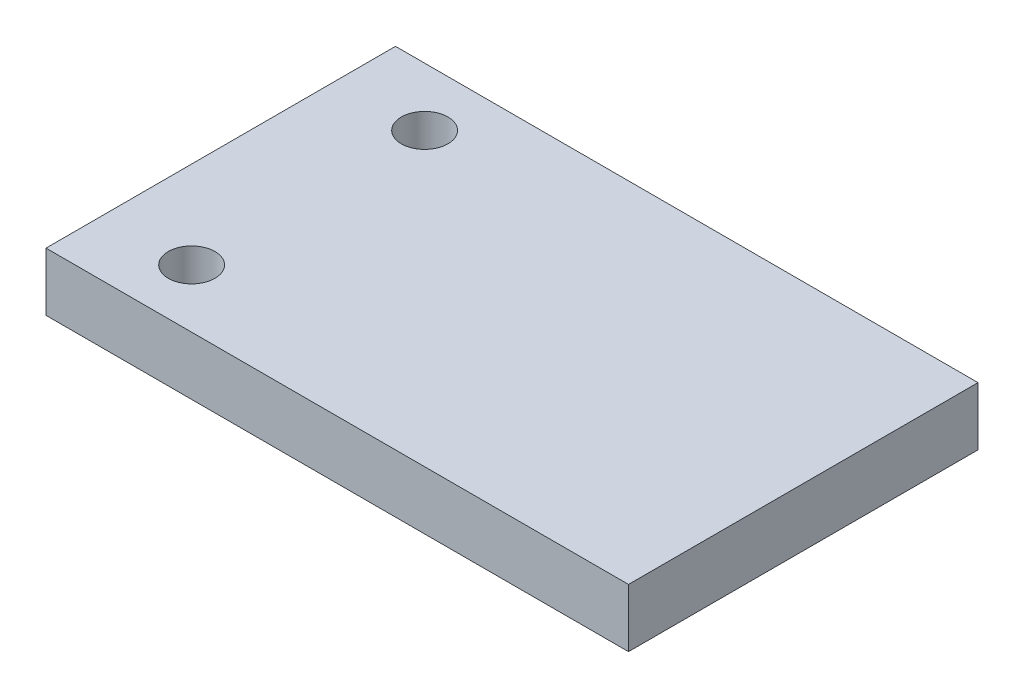
ISO-10303-21;
HEADER;
FILE_DESCRIPTION(('STEP AP214'),'2;1');
FILE_NAME('part.step','',(''),(''),'','','');
FILE_SCHEMA(('AUTOMOTIVE_DESIGN { 1 0 10303 214 1 1 1 1 }'));
ENDSEC;
DATA;
#1=APPLICATION_CONTEXT('core data for automotive mechanical design processes');
#2=APPLICATION_PROTOCOL_DEFINITION('international standard','automotive_design',2000,#1);
#3=PRODUCT_CONTEXT('',#1,'mechanical');
#4=PRODUCT('Part','Part','',(#3));
#5=PRODUCT_RELATED_PRODUCT_CATEGORY('part','',(#4));
#6=PRODUCT_DEFINITION_FORMATION('','',#4);
#7=PRODUCT_DEFINITION_CONTEXT('part definition',#1,'design');
#8=PRODUCT_DEFINITION('design','',#6,#7);
#9=PRODUCT_DEFINITION_SHAPE('','',#8);
#10=(LENGTH_UNIT() NAMED_UNIT(*) SI_UNIT(.MILLI.,.METRE.));
#11=(NAMED_UNIT(*) PLANE_ANGLE_UNIT() SI_UNIT($,.RADIAN.));
#12=(NAMED_UNIT(*) SI_UNIT($,.STERADIAN.) SOLID_ANGLE_UNIT());
#13=UNCERTAINTY_MEASURE_WITH_UNIT(LENGTH_MEASURE(1.E-05),#10,'distance_accuracy_value','');
#14=(GEOMETRIC_REPRESENTATION_CONTEXT(3) GLOBAL_UNCERTAINTY_ASSIGNED_CONTEXT((#13)) GLOBAL_UNIT_ASSIGNED_CONTEXT((#10,
#11,#12)) REPRESENTATION_CONTEXT('',''));
#15=CARTESIAN_POINT('',(0.,0.,0.));
#16=DIRECTION('',(0.,0.,1.));
#17=DIRECTION('',(1.,0.,0.));
#18=AXIS2_PLACEMENT_3D('',#15,#16,#17);
#19=CARTESIAN_POINT('',(-25.,5.,15.));
#20=DIRECTION('',(1.,0.,0.));
#21=DIRECTION('',(0.,0.,-1.));
#22=AXIS2_PLACEMENT_3D('',#19,#20,#21);
#23=PLANE('',#22);
#24=DIRECTION('',(0.,0.,1.));
#25=VECTOR('',#24,1.);
#26=CARTESIAN_POINT('',(-25.,0.,15.));
#27=LINE('',#26,#25);
#28=CARTESIAN_POINT('',(-25.,0.,-15.));
#29=VERTEX_POINT('',#28);
#30=CARTESIAN_POINT('',(-25.,0.,15.));
#31=VERTEX_POINT('',#30);
#32=EDGE_CURVE('E96',#29,#31,#27,.T.);
#33=ORIENTED_EDGE('',*,*,#32,.T.);
#34=DIRECTION('',(0.,-1.,0.));
#35=VECTOR('',#34,1.);
#36=CARTESIAN_POINT('',(-25.,5.,15.));
#37=LINE('',#36,#35);
#38=CARTESIAN_POINT('',(-25.,5.,15.));
#39=VERTEX_POINT('',#38);
#40=EDGE_CURVE('E11',#39,#31,#37,.T.);
#41=ORIENTED_EDGE('',*,*,#40,.F.);
#42=DIRECTION('',(0.,0.,1.));
#43=VECTOR('',#42,1.);
#44=CARTESIAN_POINT('',(-25.,5.,15.));
#45=LINE('',#44,#43);
#46=CARTESIAN_POINT('',(-25.,5.,-15.));
#47=VERTEX_POINT('',#46);
#48=EDGE_CURVE('E84',#47,#39,#45,.T.);
#49=ORIENTED_EDGE('',*,*,#48,.F.);
#50=DIRECTION('',(0.,-1.,0.));
#51=VECTOR('',#50,1.);
#52=CARTESIAN_POINT('',(-25.,5.,-15.));
#53=LINE('',#52,#51);
#54=EDGE_CURVE('E92',#47,#29,#53,.T.);
#55=ORIENTED_EDGE('',*,*,#54,.T.);
#56=EDGE_LOOP('',(#33,#41,#49,#55));
#57=FACE_BOUND('',#56,.T.);
#58=ADVANCED_FACE('F33',(#57),#23,.F.);
#59=CARTESIAN_POINT('',(25.,5.,15.));
#60=DIRECTION('',(0.,0.,-1.));
#61=DIRECTION('',(-1.,0.,0.));
#62=AXIS2_PLACEMENT_3D('',#59,#60,#61);
#63=PLANE('',#62);
#64=DIRECTION('',(1.,0.,0.));
#65=VECTOR('',#64,1.);
#66=CARTESIAN_POINT('',(25.,0.,15.));
#67=LINE('',#66,#65);
#68=CARTESIAN_POINT('',(25.,0.,15.));
#69=VERTEX_POINT('',#68);
#70=EDGE_CURVE('E88',#31,#69,#67,.T.);
#71=ORIENTED_EDGE('',*,*,#70,.T.);
#72=DIRECTION('',(0.,-1.,0.));
#73=VECTOR('',#72,1.);
#74=CARTESIAN_POINT('',(25.,5.,15.));
#75=LINE('',#74,#73);
#76=CARTESIAN_POINT('',(25.,5.,15.));
#77=VERTEX_POINT('',#76);
#78=EDGE_CURVE('E41',#77,#69,#75,.T.);
#79=ORIENTED_EDGE('',*,*,#78,.F.);
#80=DIRECTION('',(1.,0.,0.));
#81=VECTOR('',#80,1.);
#82=CARTESIAN_POINT('',(25.,5.,15.));
#83=LINE('',#82,#81);
#84=EDGE_CURVE('E79',#39,#77,#83,.T.);
#85=ORIENTED_EDGE('',*,*,#84,.F.);
#86=ORIENTED_EDGE('',*,*,#40,.T.);
#87=EDGE_LOOP('',(#71,#79,#85,#86));
#88=FACE_BOUND('',#87,.T.);
#89=ADVANCED_FACE('F87',(#88),#63,.F.);
#90=CARTESIAN_POINT('',(25.,5.,15.));
#91=DIRECTION('',(-1.,0.,0.));
#92=DIRECTION('',(0.,0.,1.));
#93=AXIS2_PLACEMENT_3D('',#90,#91,#92);
#94=PLANE('',#93);
#95=DIRECTION('',(0.,0.,-1.));
#96=VECTOR('',#95,1.);
#97=CARTESIAN_POINT('',(25.,0.,15.));
#98=LINE('',#97,#96);
#99=CARTESIAN_POINT('',(25.,0.,-15.));
#100=VERTEX_POINT('',#99);
#101=EDGE_CURVE('E66',#69,#100,#98,.T.);
#102=ORIENTED_EDGE('',*,*,#101,.T.);
#103=DIRECTION('',(0.,-1.,0.));
#104=VECTOR('',#103,1.);
#105=CARTESIAN_POINT('',(25.,5.,-15.));
#106=LINE('',#105,#104);
#107=CARTESIAN_POINT('',(25.,5.,-15.));
#108=VERTEX_POINT('',#107);
#109=EDGE_CURVE('E89',#108,#100,#106,.T.);
#110=ORIENTED_EDGE('',*,*,#109,.F.);
#111=DIRECTION('',(0.,0.,-1.));
#112=VECTOR('',#111,1.);
#113=CARTESIAN_POINT('',(25.,5.,15.));
#114=LINE('',#113,#112);
#115=EDGE_CURVE('E82',#77,#108,#114,.T.);
#116=ORIENTED_EDGE('',*,*,#115,.F.);
#117=ORIENTED_EDGE('',*,*,#78,.T.);
#118=EDGE_LOOP('',(#102,#110,#116,#117));
#119=FACE_BOUND('',#118,.T.);
#120=ADVANCED_FACE('F90',(#119),#94,.F.);
#121=CARTESIAN_POINT('',(25.,5.,-15.));
#122=DIRECTION('',(0.,0.,1.));
#123=DIRECTION('',(1.,0.,0.));
#124=AXIS2_PLACEMENT_3D('',#121,#122,#123);
#125=PLANE('',#124);
#126=DIRECTION('',(-1.,0.,0.));
#127=VECTOR('',#126,1.);
#128=CARTESIAN_POINT('',(25.,0.,-15.));
#129=LINE('',#128,#127);
#130=EDGE_CURVE('E72',#100,#29,#129,.T.);
#131=ORIENTED_EDGE('',*,*,#130,.T.);
#132=ORIENTED_EDGE('',*,*,#54,.F.);
#133=DIRECTION('',(-1.,0.,0.));
#134=VECTOR('',#133,1.);
#135=CARTESIAN_POINT('',(25.,5.,-15.));
#136=LINE('',#135,#134);
#137=EDGE_CURVE('E49',#108,#47,#136,.T.);
#138=ORIENTED_EDGE('',*,*,#137,.F.);
#139=ORIENTED_EDGE('',*,*,#109,.T.);
#140=EDGE_LOOP('',(#131,#132,#138,#139));
#141=FACE_BOUND('',#140,.T.);
#142=ADVANCED_FACE('F104',(#141),#125,.F.);
#143=CARTESIAN_POINT('',(0.,5.,0.));
#144=DIRECTION('',(0.,1.,0.));
#145=DIRECTION('',(0.,0.,1.));
#146=AXIS2_PLACEMENT_3D('',#143,#144,#145);
#147=PLANE('',#146);
#148=CARTESIAN_POINT('',(-17.5,5.,-10.));
#149=DIRECTION('',(0.,1.,0.));
#150=DIRECTION('',(0.,0.,1.));
#151=AXIS2_PLACEMENT_3D('',#148,#149,#150);
#152=CIRCLE('',#151,2.);
#153=CARTESIAN_POINT('',(-17.5,5.,-8.));
#154=VERTEX_POINT('',#153);
#155=EDGE_CURVE('E116',#154,#154,#152,.T.);
#156=ORIENTED_EDGE('',*,*,#155,.F.);
#157=EDGE_LOOP('',(#156));
#158=FACE_BOUND('',#157,.T.);
#159=CARTESIAN_POINT('',(-17.5,5.,10.));
#160=DIRECTION('',(0.,1.,0.));
#161=DIRECTION('',(0.,0.,1.));
#162=AXIS2_PLACEMENT_3D('',#159,#160,#161);
#163=CIRCLE('',#162,2.);
#164=CARTESIAN_POINT('',(-17.5,5.,12.));
#165=VERTEX_POINT('',#164);
#166=EDGE_CURVE('E110',#165,#165,#163,.T.);
#167=ORIENTED_EDGE('',*,*,#166,.F.);
#168=EDGE_LOOP('',(#167));
#169=FACE_BOUND('',#168,.T.);
#170=ORIENTED_EDGE('',*,*,#48,.T.);
#171=ORIENTED_EDGE('',*,*,#84,.T.);
#172=ORIENTED_EDGE('',*,*,#115,.T.);
#173=ORIENTED_EDGE('',*,*,#137,.T.);
#174=EDGE_LOOP('',(#170,#171,#172,#173));
#175=FACE_BOUND('',#174,.T.);
#176=ADVANCED_FACE('F80',(#158,#169,#175),#147,.T.);
#177=CARTESIAN_POINT('',(0.,0.,0.));
#178=DIRECTION('',(0.,1.,0.));
#179=DIRECTION('',(0.,0.,1.));
#180=AXIS2_PLACEMENT_3D('',#177,#178,#179);
#181=PLANE('',#180);
#182=CARTESIAN_POINT('',(-17.5,0.,-10.));
#183=DIRECTION('',(0.,1.,0.));
#184=DIRECTION('',(0.,0.,1.));
#185=AXIS2_PLACEMENT_3D('',#182,#183,#184);
#186=CIRCLE('',#185,2.);
#187=CARTESIAN_POINT('',(-17.5,0.,-8.));
#188=VERTEX_POINT('',#187);
#189=EDGE_CURVE('E99',#188,#188,#186,.T.);
#190=ORIENTED_EDGE('',*,*,#189,.T.);
#191=EDGE_LOOP('',(#190));
#192=FACE_BOUND('',#191,.T.);
#193=CARTESIAN_POINT('',(-17.5,0.,10.));
#194=DIRECTION('',(0.,1.,0.));
#195=DIRECTION('',(0.,0.,1.));
#196=AXIS2_PLACEMENT_3D('',#193,#194,#195);
#197=CIRCLE('',#196,2.);
#198=CARTESIAN_POINT('',(-17.5,0.,12.));
#199=VERTEX_POINT('',#198);
#200=EDGE_CURVE('E113',#199,#199,#197,.T.);
#201=ORIENTED_EDGE('',*,*,#200,.T.);
#202=EDGE_LOOP('',(#201));
#203=FACE_BOUND('',#202,.T.);
#204=ORIENTED_EDGE('',*,*,#32,.F.);
#205=ORIENTED_EDGE('',*,*,#130,.F.);
#206=ORIENTED_EDGE('',*,*,#101,.F.);
#207=ORIENTED_EDGE('',*,*,#70,.F.);
#208=EDGE_LOOP('',(#204,#205,#206,#207));
#209=FACE_BOUND('',#208,.T.);
#210=ADVANCED_FACE('F107',(#192,#203,#209),#181,.F.);
#211=CARTESIAN_POINT('',(-17.5,0.,10.));
#212=DIRECTION('',(0.,1.,0.));
#213=DIRECTION('',(0.,0.,1.));
#214=AXIS2_PLACEMENT_3D('',#211,#212,#213);
#215=CYLINDRICAL_SURFACE('',#214,2.);
#216=ORIENTED_EDGE('',*,*,#200,.F.);
#217=EDGE_LOOP('',(#216));
#218=FACE_BOUND('',#217,.T.);
#219=ORIENTED_EDGE('',*,*,#166,.T.);
#220=EDGE_LOOP('',(#219));
#221=FACE_BOUND('',#220,.T.);
#222=ADVANCED_FACE('F127',(#218,#221),#215,.F.);
#223=CARTESIAN_POINT('',(-17.5,0.,-10.));
#224=DIRECTION('',(0.,1.,0.));
#225=DIRECTION('',(0.,0.,1.));
#226=AXIS2_PLACEMENT_3D('',#223,#224,#225);
#227=CYLINDRICAL_SURFACE('',#226,2.);
#228=ORIENTED_EDGE('',*,*,#189,.F.);
#229=EDGE_LOOP('',(#228));
#230=FACE_BOUND('',#229,.T.);
#231=ORIENTED_EDGE('',*,*,#155,.T.);
#232=EDGE_LOOP('',(#231));
#233=FACE_BOUND('',#232,.T.);
#234=ADVANCED_FACE('F124',(#230,#233),#227,.F.);
#235=CLOSED_SHELL('',(#58,#89,#120,#142,#176,#210,#222,#234));
#236=MANIFOLD_SOLID_BREP('B2',#235);
#237=ADVANCED_BREP_SHAPE_REPRESENTATION('',(#18,#236),#14);
#238=SHAPE_DEFINITION_REPRESENTATION(#9,#237);
ENDSEC;
END-ISO-10303-21;
